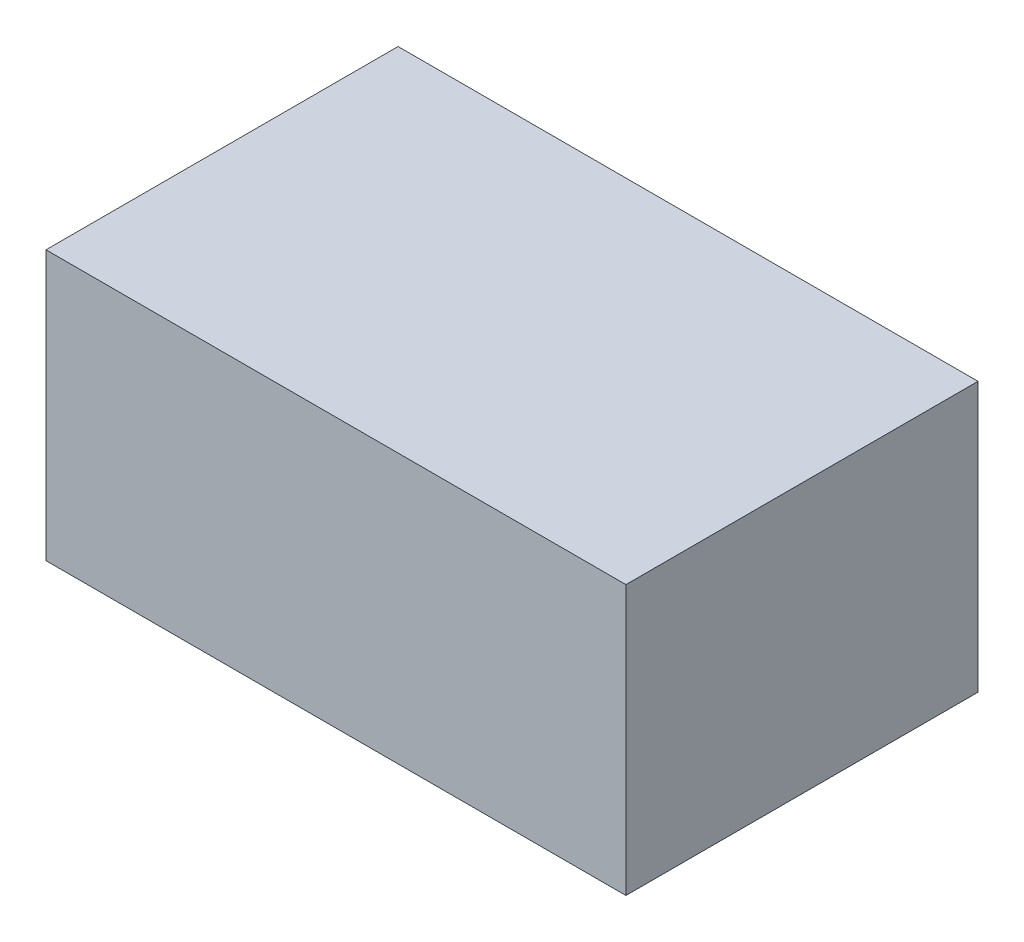
ISO-10303-21;
HEADER;
FILE_DESCRIPTION(('STEP AP214'),'2;1');
FILE_NAME('part.step','',(''),(''),'','','');
FILE_SCHEMA(('AUTOMOTIVE_DESIGN { 1 0 10303 214 1 1 1 1 }'));
ENDSEC;
DATA;
#1=APPLICATION_CONTEXT('core data for automotive mechanical design processes');
#2=APPLICATION_PROTOCOL_DEFINITION('international standard','automotive_design',2000,#1);
#3=PRODUCT_CONTEXT('',#1,'mechanical');
#4=PRODUCT('Part','Part','',(#3));
#5=PRODUCT_RELATED_PRODUCT_CATEGORY('part','',(#4));
#6=PRODUCT_DEFINITION_FORMATION('','',#4);
#7=PRODUCT_DEFINITION_CONTEXT('part definition',#1,'design');
#8=PRODUCT_DEFINITION('design','',#6,#7);
#9=PRODUCT_DEFINITION_SHAPE('','',#8);
#10=(LENGTH_UNIT() NAMED_UNIT(*) SI_UNIT(.MILLI.,.METRE.));
#11=(NAMED_UNIT(*) PLANE_ANGLE_UNIT() SI_UNIT($,.RADIAN.));
#12=(NAMED_UNIT(*) SI_UNIT($,.STERADIAN.) SOLID_ANGLE_UNIT());
#13=UNCERTAINTY_MEASURE_WITH_UNIT(LENGTH_MEASURE(1.E-05),#10,'distance_accuracy_value','');
#14=(GEOMETRIC_REPRESENTATION_CONTEXT(3) GLOBAL_UNCERTAINTY_ASSIGNED_CONTEXT((#13)) GLOBAL_UNIT_ASSIGNED_CONTEXT((#10,
#11,#12)) REPRESENTATION_CONTEXT('',''));
#15=CARTESIAN_POINT('',(0.,0.,0.));
#16=DIRECTION('',(0.,0.,1.));
#17=DIRECTION('',(1.,0.,0.));
#18=AXIS2_PLACEMENT_3D('',#15,#16,#17);
#19=CARTESIAN_POINT('',(35.56,16.51,-21.59));
#20=DIRECTION('',(-1.,0.,0.));
#21=DIRECTION('',(0.,0.,1.));
#22=AXIS2_PLACEMENT_3D('',#19,#20,#21);
#23=PLANE('',#22);
#24=DIRECTION('',(0.,0.,-1.));
#25=VECTOR('',#24,1.);
#26=CARTESIAN_POINT('',(35.56,-16.51,-21.59));
#27=LINE('',#26,#25);
#28=CARTESIAN_POINT('',(35.56,-16.51,21.59));
#29=VERTEX_POINT('',#28);
#30=CARTESIAN_POINT('',(35.56,-16.51,-21.59));
#31=VERTEX_POINT('',#30);
#32=EDGE_CURVE('E99',#29,#31,#27,.T.);
#33=ORIENTED_EDGE('',*,*,#32,.T.);
#34=DIRECTION('',(0.,-1.,0.));
#35=VECTOR('',#34,1.);
#36=CARTESIAN_POINT('',(35.56,16.51,-21.59));
#37=LINE('',#36,#35);
#38=CARTESIAN_POINT('',(35.56,16.51,-21.59));
#39=VERTEX_POINT('',#38);
#40=EDGE_CURVE('E11',#39,#31,#37,.T.);
#41=ORIENTED_EDGE('',*,*,#40,.F.);
#42=DIRECTION('',(0.,0.,-1.));
#43=VECTOR('',#42,1.);
#44=CARTESIAN_POINT('',(35.56,16.51,-21.59));
#45=LINE('',#44,#43);
#46=CARTESIAN_POINT('',(35.56,16.51,21.59));
#47=VERTEX_POINT('',#46);
#48=EDGE_CURVE('E87',#47,#39,#45,.T.);
#49=ORIENTED_EDGE('',*,*,#48,.F.);
#50=DIRECTION('',(0.,-1.,0.));
#51=VECTOR('',#50,1.);
#52=CARTESIAN_POINT('',(35.56,16.51,21.59));
#53=LINE('',#52,#51);
#54=EDGE_CURVE('E95',#47,#29,#53,.T.);
#55=ORIENTED_EDGE('',*,*,#54,.T.);
#56=EDGE_LOOP('',(#33,#41,#49,#55));
#57=FACE_BOUND('',#56,.T.);
#58=ADVANCED_FACE('F36',(#57),#23,.F.);
#59=CARTESIAN_POINT('',(-35.56,16.51,-21.59));
#60=DIRECTION('',(0.,0.,1.));
#61=DIRECTION('',(1.,0.,0.));
#62=AXIS2_PLACEMENT_3D('',#59,#60,#61);
#63=PLANE('',#62);
#64=DIRECTION('',(-1.,0.,0.));
#65=VECTOR('',#64,1.);
#66=CARTESIAN_POINT('',(-35.56,-16.51,-21.59));
#67=LINE('',#66,#65);
#68=CARTESIAN_POINT('',(-35.56,-16.51,-21.59));
#69=VERTEX_POINT('',#68);
#70=EDGE_CURVE('E91',#31,#69,#67,.T.);
#71=ORIENTED_EDGE('',*,*,#70,.T.);
#72=DIRECTION('',(0.,-1.,0.));
#73=VECTOR('',#72,1.);
#74=CARTESIAN_POINT('',(-35.56,16.51,-21.59));
#75=LINE('',#74,#73);
#76=CARTESIAN_POINT('',(-35.56,16.51,-21.59));
#77=VERTEX_POINT('',#76);
#78=EDGE_CURVE('E44',#77,#69,#75,.T.);
#79=ORIENTED_EDGE('',*,*,#78,.F.);
#80=DIRECTION('',(-1.,0.,0.));
#81=VECTOR('',#80,1.);
#82=CARTESIAN_POINT('',(-35.56,16.51,-21.59));
#83=LINE('',#82,#81);
#84=EDGE_CURVE('E82',#39,#77,#83,.T.);
#85=ORIENTED_EDGE('',*,*,#84,.F.);
#86=ORIENTED_EDGE('',*,*,#40,.T.);
#87=EDGE_LOOP('',(#71,#79,#85,#86));
#88=FACE_BOUND('',#87,.T.);
#89=ADVANCED_FACE('F90',(#88),#63,.F.);
#90=CARTESIAN_POINT('',(-35.56,16.51,-21.59));
#91=DIRECTION('',(1.,0.,0.));
#92=DIRECTION('',(0.,0.,-1.));
#93=AXIS2_PLACEMENT_3D('',#90,#91,#92);
#94=PLANE('',#93);
#95=DIRECTION('',(0.,0.,1.));
#96=VECTOR('',#95,1.);
#97=CARTESIAN_POINT('',(-35.56,-16.51,-21.59));
#98=LINE('',#97,#96);
#99=CARTESIAN_POINT('',(-35.56,-16.51,21.59));
#100=VERTEX_POINT('',#99);
#101=EDGE_CURVE('E69',#69,#100,#98,.T.);
#102=ORIENTED_EDGE('',*,*,#101,.T.);
#103=DIRECTION('',(0.,-1.,0.));
#104=VECTOR('',#103,1.);
#105=CARTESIAN_POINT('',(-35.56,16.51,21.59));
#106=LINE('',#105,#104);
#107=CARTESIAN_POINT('',(-35.56,16.51,21.59));
#108=VERTEX_POINT('',#107);
#109=EDGE_CURVE('E92',#108,#100,#106,.T.);
#110=ORIENTED_EDGE('',*,*,#109,.F.);
#111=DIRECTION('',(0.,0.,1.));
#112=VECTOR('',#111,1.);
#113=CARTESIAN_POINT('',(-35.56,16.51,-21.59));
#114=LINE('',#113,#112);
#115=EDGE_CURVE('E85',#77,#108,#114,.T.);
#116=ORIENTED_EDGE('',*,*,#115,.F.);
#117=ORIENTED_EDGE('',*,*,#78,.T.);
#118=EDGE_LOOP('',(#102,#110,#116,#117));
#119=FACE_BOUND('',#118,.T.);
#120=ADVANCED_FACE('F93',(#119),#94,.F.);
#121=CARTESIAN_POINT('',(-35.56,16.51,21.59));
#122=DIRECTION('',(0.,0.,-1.));
#123=DIRECTION('',(-1.,0.,0.));
#124=AXIS2_PLACEMENT_3D('',#121,#122,#123);
#125=PLANE('',#124);
#126=DIRECTION('',(1.,0.,0.));
#127=VECTOR('',#126,1.);
#128=CARTESIAN_POINT('',(-35.56,-16.51,21.59));
#129=LINE('',#128,#127);
#130=EDGE_CURVE('E75',#100,#29,#129,.T.);
#131=ORIENTED_EDGE('',*,*,#130,.T.);
#132=ORIENTED_EDGE('',*,*,#54,.F.);
#133=DIRECTION('',(1.,0.,0.));
#134=VECTOR('',#133,1.);
#135=CARTESIAN_POINT('',(-35.56,16.51,21.59));
#136=LINE('',#135,#134);
#137=EDGE_CURVE('E52',#108,#47,#136,.T.);
#138=ORIENTED_EDGE('',*,*,#137,.F.);
#139=ORIENTED_EDGE('',*,*,#109,.T.);
#140=EDGE_LOOP('',(#131,#132,#138,#139));
#141=FACE_BOUND('',#140,.T.);
#142=ADVANCED_FACE('F106',(#141),#125,.F.);
#143=CARTESIAN_POINT('',(0.,16.51,0.));
#144=DIRECTION('',(0.,1.,0.));
#145=DIRECTION('',(0.,0.,1.));
#146=AXIS2_PLACEMENT_3D('',#143,#144,#145);
#147=PLANE('',#146);
#148=ORIENTED_EDGE('',*,*,#48,.T.);
#149=ORIENTED_EDGE('',*,*,#84,.T.);
#150=ORIENTED_EDGE('',*,*,#115,.T.);
#151=ORIENTED_EDGE('',*,*,#137,.T.);
#152=EDGE_LOOP('',(#148,#149,#150,#151));
#153=FACE_BOUND('',#152,.T.);
#154=ADVANCED_FACE('F83',(#153),#147,.T.);
#155=CARTESIAN_POINT('',(0.,-16.51,0.));
#156=DIRECTION('',(0.,1.,0.));
#157=DIRECTION('',(0.,0.,1.));
#158=AXIS2_PLACEMENT_3D('',#155,#156,#157);
#159=PLANE('',#158);
#160=ORIENTED_EDGE('',*,*,#32,.F.);
#161=ORIENTED_EDGE('',*,*,#130,.F.);
#162=ORIENTED_EDGE('',*,*,#101,.F.);
#163=ORIENTED_EDGE('',*,*,#70,.F.);
#164=EDGE_LOOP('',(#160,#161,#162,#163));
#165=FACE_BOUND('',#164,.T.);
#166=ADVANCED_FACE('F109',(#165),#159,.F.);
#167=CLOSED_SHELL('',(#58,#89,#120,#142,#154,#166));
#168=MANIFOLD_SOLID_BREP('B2',#167);
#169=ADVANCED_BREP_SHAPE_REPRESENTATION('',(#18,#168),#14);
#170=SHAPE_DEFINITION_REPRESENTATION(#9,#169);
ENDSEC;
END-ISO-10303-21;
